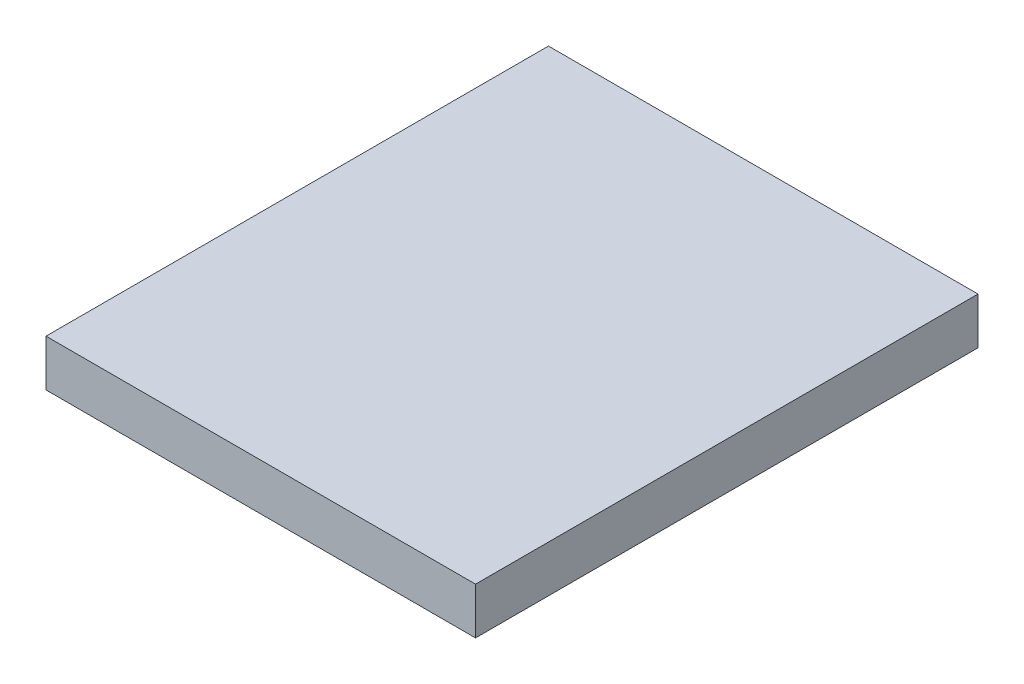
ISO-10303-21;
HEADER;
FILE_DESCRIPTION(('STEP AP214'),'2;1');
FILE_NAME('part.step','',(''),(''),'','','');
FILE_SCHEMA(('AUTOMOTIVE_DESIGN { 1 0 10303 214 1 1 1 1 }'));
ENDSEC;
DATA;
#1=APPLICATION_CONTEXT('core data for automotive mechanical design processes');
#2=APPLICATION_PROTOCOL_DEFINITION('international standard','automotive_design',2000,#1);
#3=PRODUCT_CONTEXT('',#1,'mechanical');
#4=PRODUCT('Part','Part','',(#3));
#5=PRODUCT_RELATED_PRODUCT_CATEGORY('part','',(#4));
#6=PRODUCT_DEFINITION_FORMATION('','',#4);
#7=PRODUCT_DEFINITION_CONTEXT('part definition',#1,'design');
#8=PRODUCT_DEFINITION('design','',#6,#7);
#9=PRODUCT_DEFINITION_SHAPE('','',#8);
#10=(LENGTH_UNIT() NAMED_UNIT(*) SI_UNIT(.MILLI.,.METRE.));
#11=(NAMED_UNIT(*) PLANE_ANGLE_UNIT() SI_UNIT($,.RADIAN.));
#12=(NAMED_UNIT(*) SI_UNIT($,.STERADIAN.) SOLID_ANGLE_UNIT());
#13=UNCERTAINTY_MEASURE_WITH_UNIT(LENGTH_MEASURE(1.E-05),#10,'distance_accuracy_value','');
#14=(GEOMETRIC_REPRESENTATION_CONTEXT(3) GLOBAL_UNCERTAINTY_ASSIGNED_CONTEXT((#13)) GLOBAL_UNIT_ASSIGNED_CONTEXT((#10,
#11,#12)) REPRESENTATION_CONTEXT('',''));
#15=CARTESIAN_POINT('',(0.,0.,0.));
#16=DIRECTION('',(0.,0.,1.));
#17=DIRECTION('',(1.,0.,0.));
#18=AXIS2_PLACEMENT_3D('',#15,#16,#17);
#19=CARTESIAN_POINT('',(26.5,5.75,31.));
#20=DIRECTION('',(-1.,0.,0.));
#21=DIRECTION('',(0.,0.,1.));
#22=AXIS2_PLACEMENT_3D('',#19,#20,#21);
#23=PLANE('',#22);
#24=DIRECTION('',(0.,0.,-1.));
#25=VECTOR('',#24,1.);
#26=CARTESIAN_POINT('',(26.5,0.,31.));
#27=LINE('',#26,#25);
#28=CARTESIAN_POINT('',(26.5,0.,31.));
#29=VERTEX_POINT('',#28);
#30=CARTESIAN_POINT('',(26.5,0.,-31.));
#31=VERTEX_POINT('',#30);
#32=EDGE_CURVE('E96',#29,#31,#27,.T.);
#33=ORIENTED_EDGE('',*,*,#32,.T.);
#34=DIRECTION('',(0.,-1.,0.));
#35=VECTOR('',#34,1.);
#36=CARTESIAN_POINT('',(26.5,5.75,-31.));
#37=LINE('',#36,#35);
#38=CARTESIAN_POINT('',(26.5,5.75,-31.));
#39=VERTEX_POINT('',#38);
#40=EDGE_CURVE('E11',#39,#31,#37,.T.);
#41=ORIENTED_EDGE('',*,*,#40,.F.);
#42=DIRECTION('',(0.,0.,-1.));
#43=VECTOR('',#42,1.);
#44=CARTESIAN_POINT('',(26.5,5.75,31.));
#45=LINE('',#44,#43);
#46=CARTESIAN_POINT('',(26.5,5.75,31.));
#47=VERTEX_POINT('',#46);
#48=EDGE_CURVE('E84',#47,#39,#45,.T.);
#49=ORIENTED_EDGE('',*,*,#48,.F.);
#50=DIRECTION('',(0.,-1.,0.));
#51=VECTOR('',#50,1.);
#52=CARTESIAN_POINT('',(26.5,5.75,31.));
#53=LINE('',#52,#51);
#54=EDGE_CURVE('E92',#47,#29,#53,.T.);
#55=ORIENTED_EDGE('',*,*,#54,.T.);
#56=EDGE_LOOP('',(#33,#41,#49,#55));
#57=FACE_BOUND('',#56,.T.);
#58=ADVANCED_FACE('F33',(#57),#23,.F.);
#59=CARTESIAN_POINT('',(-26.5,5.75,-31.));
#60=DIRECTION('',(0.,0.,1.));
#61=DIRECTION('',(1.,0.,0.));
#62=AXIS2_PLACEMENT_3D('',#59,#60,#61);
#63=PLANE('',#62);
#64=DIRECTION('',(-1.,0.,0.));
#65=VECTOR('',#64,1.);
#66=CARTESIAN_POINT('',(-26.5,0.,-31.));
#67=LINE('',#66,#65);
#68=CARTESIAN_POINT('',(-26.5,0.,-31.));
#69=VERTEX_POINT('',#68);
#70=EDGE_CURVE('E88',#31,#69,#67,.T.);
#71=ORIENTED_EDGE('',*,*,#70,.T.);
#72=DIRECTION('',(0.,-1.,0.));
#73=VECTOR('',#72,1.);
#74=CARTESIAN_POINT('',(-26.5,5.75,-31.));
#75=LINE('',#74,#73);
#76=CARTESIAN_POINT('',(-26.5,5.75,-31.));
#77=VERTEX_POINT('',#76);
#78=EDGE_CURVE('E41',#77,#69,#75,.T.);
#79=ORIENTED_EDGE('',*,*,#78,.F.);
#80=DIRECTION('',(-1.,0.,0.));
#81=VECTOR('',#80,1.);
#82=CARTESIAN_POINT('',(-26.5,5.75,-31.));
#83=LINE('',#82,#81);
#84=EDGE_CURVE('E79',#39,#77,#83,.T.);
#85=ORIENTED_EDGE('',*,*,#84,.F.);
#86=ORIENTED_EDGE('',*,*,#40,.T.);
#87=EDGE_LOOP('',(#71,#79,#85,#86));
#88=FACE_BOUND('',#87,.T.);
#89=ADVANCED_FACE('F87',(#88),#63,.F.);
#90=CARTESIAN_POINT('',(-26.5,5.75,31.));
#91=DIRECTION('',(1.,0.,0.));
#92=DIRECTION('',(0.,0.,-1.));
#93=AXIS2_PLACEMENT_3D('',#90,#91,#92);
#94=PLANE('',#93);
#95=DIRECTION('',(0.,0.,1.));
#96=VECTOR('',#95,1.);
#97=CARTESIAN_POINT('',(-26.5,0.,31.));
#98=LINE('',#97,#96);
#99=CARTESIAN_POINT('',(-26.5,0.,31.));
#100=VERTEX_POINT('',#99);
#101=EDGE_CURVE('E66',#69,#100,#98,.T.);
#102=ORIENTED_EDGE('',*,*,#101,.T.);
#103=DIRECTION('',(0.,-1.,0.));
#104=VECTOR('',#103,1.);
#105=CARTESIAN_POINT('',(-26.5,5.75,31.));
#106=LINE('',#105,#104);
#107=CARTESIAN_POINT('',(-26.5,5.75,31.));
#108=VERTEX_POINT('',#107);
#109=EDGE_CURVE('E89',#108,#100,#106,.T.);
#110=ORIENTED_EDGE('',*,*,#109,.F.);
#111=DIRECTION('',(0.,0.,1.));
#112=VECTOR('',#111,1.);
#113=CARTESIAN_POINT('',(-26.5,5.75,31.));
#114=LINE('',#113,#112);
#115=EDGE_CURVE('E82',#77,#108,#114,.T.);
#116=ORIENTED_EDGE('',*,*,#115,.F.);
#117=ORIENTED_EDGE('',*,*,#78,.T.);
#118=EDGE_LOOP('',(#102,#110,#116,#117));
#119=FACE_BOUND('',#118,.T.);
#120=ADVANCED_FACE('F90',(#119),#94,.F.);
#121=CARTESIAN_POINT('',(-26.5,5.75,31.));
#122=DIRECTION('',(0.,0.,-1.));
#123=DIRECTION('',(-1.,0.,0.));
#124=AXIS2_PLACEMENT_3D('',#121,#122,#123);
#125=PLANE('',#124);
#126=DIRECTION('',(1.,0.,0.));
#127=VECTOR('',#126,1.);
#128=CARTESIAN_POINT('',(-26.5,0.,31.));
#129=LINE('',#128,#127);
#130=EDGE_CURVE('E72',#100,#29,#129,.T.);
#131=ORIENTED_EDGE('',*,*,#130,.T.);
#132=ORIENTED_EDGE('',*,*,#54,.F.);
#133=DIRECTION('',(1.,0.,0.));
#134=VECTOR('',#133,1.);
#135=CARTESIAN_POINT('',(-26.5,5.75,31.));
#136=LINE('',#135,#134);
#137=EDGE_CURVE('E49',#108,#47,#136,.T.);
#138=ORIENTED_EDGE('',*,*,#137,.F.);
#139=ORIENTED_EDGE('',*,*,#109,.T.);
#140=EDGE_LOOP('',(#131,#132,#138,#139));
#141=FACE_BOUND('',#140,.T.);
#142=ADVANCED_FACE('F103',(#141),#125,.F.);
#143=CARTESIAN_POINT('',(0.,5.75,0.));
#144=DIRECTION('',(0.,-1.,0.));
#145=DIRECTION('',(0.,0.,-1.));
#146=AXIS2_PLACEMENT_3D('',#143,#144,#145);
#147=PLANE('',#146);
#148=ORIENTED_EDGE('',*,*,#48,.T.);
#149=ORIENTED_EDGE('',*,*,#84,.T.);
#150=ORIENTED_EDGE('',*,*,#115,.T.);
#151=ORIENTED_EDGE('',*,*,#137,.T.);
#152=EDGE_LOOP('',(#148,#149,#150,#151));
#153=FACE_BOUND('',#152,.T.);
#154=ADVANCED_FACE('F80',(#153),#147,.F.);
#155=CARTESIAN_POINT('',(0.,0.,0.));
#156=DIRECTION('',(0.,-1.,0.));
#157=DIRECTION('',(0.,0.,-1.));
#158=AXIS2_PLACEMENT_3D('',#155,#156,#157);
#159=PLANE('',#158);
#160=ORIENTED_EDGE('',*,*,#32,.F.);
#161=ORIENTED_EDGE('',*,*,#130,.F.);
#162=ORIENTED_EDGE('',*,*,#101,.F.);
#163=ORIENTED_EDGE('',*,*,#70,.F.);
#164=EDGE_LOOP('',(#160,#161,#162,#163));
#165=FACE_BOUND('',#164,.T.);
#166=ADVANCED_FACE('F106',(#165),#159,.T.);
#167=CLOSED_SHELL('',(#58,#89,#120,#142,#154,#166));
#168=MANIFOLD_SOLID_BREP('B2',#167);
#169=ADVANCED_BREP_SHAPE_REPRESENTATION('',(#18,#168),#14);
#170=SHAPE_DEFINITION_REPRESENTATION(#9,#169);
ENDSEC;
END-ISO-10303-21;
